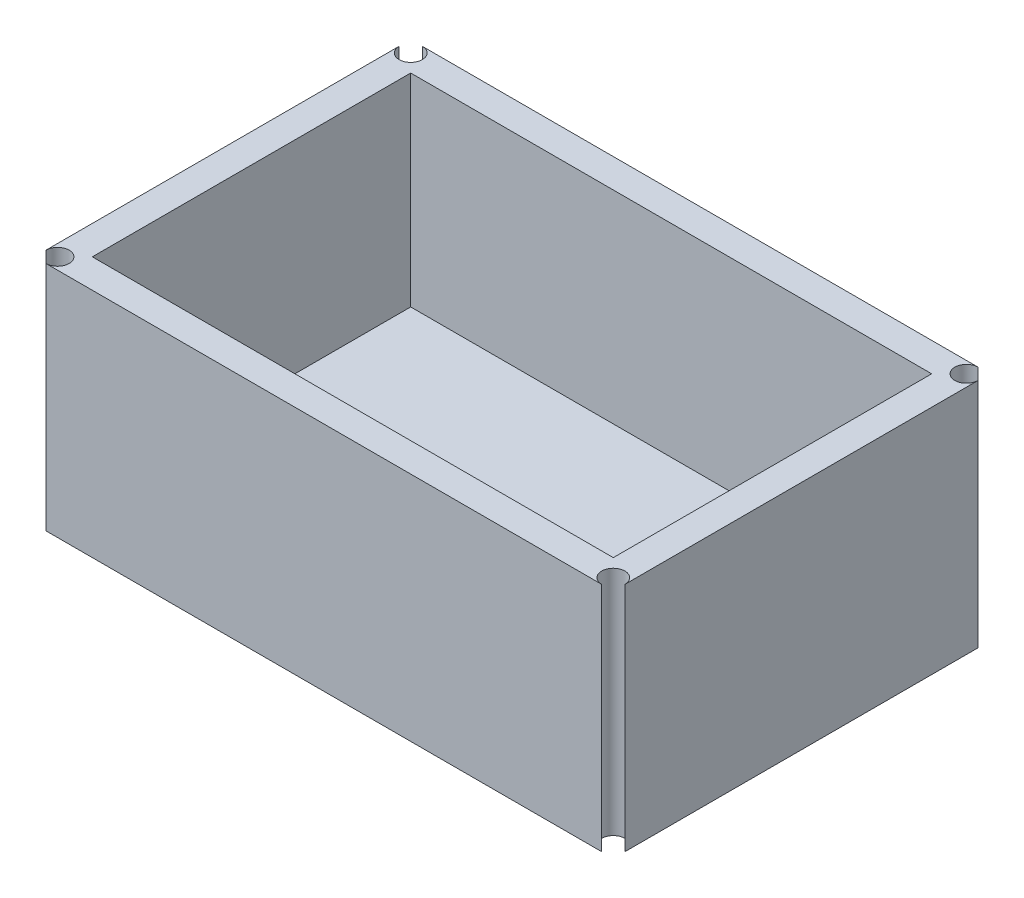
ISO-10303-21;
HEADER;
FILE_DESCRIPTION(('STEP AP214'),'2;1');
FILE_NAME('part.step','',(''),(''),'','','');
FILE_SCHEMA(('AUTOMOTIVE_DESIGN { 1 0 10303 214 1 1 1 1 }'));
ENDSEC;
DATA;
#1=APPLICATION_CONTEXT('core data for automotive mechanical design processes');
#2=APPLICATION_PROTOCOL_DEFINITION('international standard','automotive_design',2000,#1);
#3=PRODUCT_CONTEXT('',#1,'mechanical');
#4=PRODUCT('Part','Part','',(#3));
#5=PRODUCT_RELATED_PRODUCT_CATEGORY('part','',(#4));
#6=PRODUCT_DEFINITION_FORMATION('','',#4);
#7=PRODUCT_DEFINITION_CONTEXT('part definition',#1,'design');
#8=PRODUCT_DEFINITION('design','',#6,#7);
#9=PRODUCT_DEFINITION_SHAPE('','',#8);
#10=(LENGTH_UNIT() NAMED_UNIT(*) SI_UNIT(.MILLI.,.METRE.));
#11=(NAMED_UNIT(*) PLANE_ANGLE_UNIT() SI_UNIT($,.RADIAN.));
#12=(NAMED_UNIT(*) SI_UNIT($,.STERADIAN.) SOLID_ANGLE_UNIT());
#13=UNCERTAINTY_MEASURE_WITH_UNIT(LENGTH_MEASURE(1.E-05),#10,'distance_accuracy_value','');
#14=(GEOMETRIC_REPRESENTATION_CONTEXT(3) GLOBAL_UNCERTAINTY_ASSIGNED_CONTEXT((#13)) GLOBAL_UNIT_ASSIGNED_CONTEXT((#10,
#11,#12)) REPRESENTATION_CONTEXT('',''));
#15=CARTESIAN_POINT('',(0.,0.,0.));
#16=DIRECTION('',(0.,0.,1.));
#17=DIRECTION('',(1.,0.,0.));
#18=AXIS2_PLACEMENT_3D('',#15,#16,#17);
#19=CARTESIAN_POINT('',(0.,40.,0.));
#20=DIRECTION('',(0.,1.,0.));
#21=DIRECTION('',(0.,0.,1.));
#22=AXIS2_PLACEMENT_3D('',#19,#20,#21);
#23=PLANE('',#22);
#24=DIRECTION('',(0.,0.,1.));
#25=VECTOR('',#24,1.);
#26=CARTESIAN_POINT('',(50.9322033898305,40.,-28.0007704160247));
#27=LINE('',#26,#25);
#28=CARTESIAN_POINT('',(50.9322033898305,40.,-28.0007704160247));
#29=VERTEX_POINT('',#28);
#30=CARTESIAN_POINT('',(50.9322033898305,40.,26.9992295839753));
#31=VERTEX_POINT('',#30);
#32=EDGE_CURVE('E188',#29,#31,#27,.T.);
#33=ORIENTED_EDGE('',*,*,#32,.T.);
#34=DIRECTION('',(-1.,0.,0.));
#35=VECTOR('',#34,1.);
#36=CARTESIAN_POINT('',(-39.0677966101695,40.,26.9992295839753));
#37=LINE('',#36,#35);
#38=CARTESIAN_POINT('',(-39.0677966101695,40.,26.9992295839753));
#39=VERTEX_POINT('',#38);
#40=EDGE_CURVE('E183',#31,#39,#37,.T.);
#41=ORIENTED_EDGE('',*,*,#40,.T.);
#42=DIRECTION('',(0.,0.,-1.));
#43=VECTOR('',#42,1.);
#44=CARTESIAN_POINT('',(-39.0677966101695,40.,-28.0007704160247));
#45=LINE('',#44,#43);
#46=CARTESIAN_POINT('',(-39.0677966101695,40.,-28.0007704160247));
#47=VERTEX_POINT('',#46);
#48=EDGE_CURVE('E194',#39,#47,#45,.T.);
#49=ORIENTED_EDGE('',*,*,#48,.T.);
#50=DIRECTION('',(1.,0.,0.));
#51=VECTOR('',#50,1.);
#52=CARTESIAN_POINT('',(-39.0677966101695,40.,-28.0007704160247));
#53=LINE('',#52,#51);
#54=EDGE_CURVE('E191',#47,#29,#53,.T.);
#55=ORIENTED_EDGE('',*,*,#54,.T.);
#56=EDGE_LOOP('',(#33,#41,#49,#55));
#57=FACE_BOUND('',#56,.T.);
#58=DIRECTION('',(1.,0.,0.));
#59=VECTOR('',#58,1.);
#60=CARTESIAN_POINT('',(-44.0677966101695,40.,31.9992295839753));
#61=LINE('',#60,#59);
#62=CARTESIAN_POINT('',(-42.0677966101695,40.,31.9992295839753));
#63=VERTEX_POINT('',#62);
#64=CARTESIAN_POINT('',(53.9322033898305,40.,31.9992295839753));
#65=VERTEX_POINT('',#64);
#66=EDGE_CURVE('E142',#63,#65,#61,.T.);
#67=ORIENTED_EDGE('',*,*,#66,.T.);
#68=CARTESIAN_POINT('',(53.9322033898305,40.,29.9992295839753));
#69=DIRECTION('',(0.,1.,0.));
#70=DIRECTION('',(0.,0.,1.));
#71=AXIS2_PLACEMENT_3D('',#68,#69,#70);
#72=CIRCLE('',#71,2.);
#73=CARTESIAN_POINT('',(55.9322033898305,40.,29.9992295839753));
#74=VERTEX_POINT('',#73);
#75=EDGE_CURVE('E169',#65,#74,#72,.F.);
#76=ORIENTED_EDGE('',*,*,#75,.T.);
#77=DIRECTION('',(0.,0.,1.));
#78=VECTOR('',#77,1.);
#79=CARTESIAN_POINT('',(55.9322033898305,40.,29.9992295839753));
#80=LINE('',#79,#78);
#81=CARTESIAN_POINT('',(55.9322033898305,40.,-31.0007704160247));
#82=VERTEX_POINT('',#81);
#83=EDGE_CURVE('E136',#82,#74,#80,.T.);
#84=ORIENTED_EDGE('',*,*,#83,.F.);
#85=CARTESIAN_POINT('',(53.9322033898305,40.,-31.0007704160247));
#86=DIRECTION('',(0.,1.,0.));
#87=DIRECTION('',(0.,0.,1.));
#88=AXIS2_PLACEMENT_3D('',#85,#86,#87);
#89=CIRCLE('',#88,2.);
#90=CARTESIAN_POINT('',(53.9322033898305,40.,-33.0007704160247));
#91=VERTEX_POINT('',#90);
#92=EDGE_CURVE('E180',#82,#91,#89,.F.);
#93=ORIENTED_EDGE('',*,*,#92,.T.);
#94=DIRECTION('',(-1.,0.,0.));
#95=VECTOR('',#94,1.);
#96=CARTESIAN_POINT('',(-44.0677966101695,40.,-33.0007704160247));
#97=LINE('',#96,#95);
#98=CARTESIAN_POINT('',(-42.0677966101695,40.,-33.0007704160247));
#99=VERTEX_POINT('',#98);
#100=EDGE_CURVE('E135',#91,#99,#97,.T.);
#101=ORIENTED_EDGE('',*,*,#100,.T.);
#102=CARTESIAN_POINT('',(-42.0677966101695,40.,-31.0007704160247));
#103=DIRECTION('',(0.,1.,0.));
#104=DIRECTION('',(0.,0.,1.));
#105=AXIS2_PLACEMENT_3D('',#102,#103,#104);
#106=CIRCLE('',#105,2.);
#107=CARTESIAN_POINT('',(-44.0677966101695,40.,-31.0007704160247));
#108=VERTEX_POINT('',#107);
#109=EDGE_CURVE('E120',#99,#108,#106,.F.);
#110=ORIENTED_EDGE('',*,*,#109,.T.);
#111=DIRECTION('',(0.,0.,1.));
#112=VECTOR('',#111,1.);
#113=CARTESIAN_POINT('',(-44.0677966101695,40.,-33.0007704160247));
#114=LINE('',#113,#112);
#115=CARTESIAN_POINT('',(-44.0677966101695,40.,29.9992295839753));
#116=VERTEX_POINT('',#115);
#117=EDGE_CURVE('E133',#108,#116,#114,.T.);
#118=ORIENTED_EDGE('',*,*,#117,.T.);
#119=CARTESIAN_POINT('',(-42.0677966101695,40.,29.9992295839753));
#120=DIRECTION('',(0.,1.,0.));
#121=DIRECTION('',(0.,0.,1.));
#122=AXIS2_PLACEMENT_3D('',#119,#120,#121);
#123=CIRCLE('',#122,2.);
#124=EDGE_CURVE('E137',#116,#63,#123,.F.);
#125=ORIENTED_EDGE('',*,*,#124,.T.);
#126=EDGE_LOOP('',(#67,#76,#84,#93,#101,#110,#118,#125));
#127=FACE_BOUND('',#126,.T.);
#128=ADVANCED_FACE('F32',(#57,#127),#23,.T.);
#129=CARTESIAN_POINT('',(-42.0677966101695,-0.00999999999999612,29.9992295839753));
#130=DIRECTION('',(0.,1.,0.));
#131=DIRECTION('',(0.,0.,1.));
#132=AXIS2_PLACEMENT_3D('',#129,#130,#131);
#133=CYLINDRICAL_SURFACE('',#132,2.);
#134=ORIENTED_EDGE('',*,*,#124,.F.);
#135=DIRECTION('',(0.,1.,0.));
#136=VECTOR('',#135,1.);
#137=CARTESIAN_POINT('',(-44.0677966101695,-0.00999999999999612,29.9992295839753));
#138=LINE('',#137,#136);
#139=CARTESIAN_POINT('',(-44.0677966101695,0.,29.9992295839753));
#140=VERTEX_POINT('',#139);
#141=EDGE_CURVE('E127',#140,#116,#138,.T.);
#142=ORIENTED_EDGE('',*,*,#141,.F.);
#143=CARTESIAN_POINT('',(-42.0677966101695,0.,29.9992295839753));
#144=DIRECTION('',(0.,1.,0.));
#145=DIRECTION('',(0.,0.,1.));
#146=AXIS2_PLACEMENT_3D('',#143,#144,#145);
#147=CIRCLE('',#146,2.);
#148=CARTESIAN_POINT('',(-42.0677966101695,0.,31.9992295839753));
#149=VERTEX_POINT('',#148);
#150=EDGE_CURVE('E235',#149,#140,#147,.T.);
#151=ORIENTED_EDGE('',*,*,#150,.F.);
#152=DIRECTION('',(0.,1.,0.));
#153=VECTOR('',#152,1.);
#154=CARTESIAN_POINT('',(-42.0677966101695,-0.00999999999999612,31.9992295839753));
#155=LINE('',#154,#153);
#156=EDGE_CURVE('E126',#149,#63,#155,.T.);
#157=ORIENTED_EDGE('',*,*,#156,.T.);
#158=EDGE_LOOP('',(#134,#142,#151,#157));
#159=FACE_BOUND('',#158,.T.);
#160=ADVANCED_FACE('F258',(#159),#133,.F.);
#161=CARTESIAN_POINT('',(-44.0677966101695,80.,31.9992295839753));
#162=DIRECTION('',(0.,0.,-1.));
#163=DIRECTION('',(-1.,0.,0.));
#164=AXIS2_PLACEMENT_3D('',#161,#162,#163);
#165=PLANE('',#164);
#166=ORIENTED_EDGE('',*,*,#66,.F.);
#167=ORIENTED_EDGE('',*,*,#156,.F.);
#168=DIRECTION('',(1.,0.,0.));
#169=VECTOR('',#168,1.);
#170=CARTESIAN_POINT('',(-44.0677966101695,0.,31.9992295839753));
#171=LINE('',#170,#169);
#172=CARTESIAN_POINT('',(53.9322033898305,0.,31.9992295839753));
#173=VERTEX_POINT('',#172);
#174=EDGE_CURVE('E233',#149,#173,#171,.T.);
#175=ORIENTED_EDGE('',*,*,#174,.T.);
#176=DIRECTION('',(0.,1.,0.));
#177=VECTOR('',#176,1.);
#178=CARTESIAN_POINT('',(53.9322033898305,-0.00999999999999612,31.9992295839753));
#179=LINE('',#178,#177);
#180=EDGE_CURVE('E160',#173,#65,#179,.T.);
#181=ORIENTED_EDGE('',*,*,#180,.T.);
#182=EDGE_LOOP('',(#166,#167,#175,#181));
#183=FACE_BOUND('',#182,.T.);
#184=ADVANCED_FACE('F268',(#183),#165,.F.);
#185=CARTESIAN_POINT('',(53.9322033898305,-0.00999999999999612,29.9992295839753));
#186=DIRECTION('',(0.,1.,0.));
#187=DIRECTION('',(0.,0.,1.));
#188=AXIS2_PLACEMENT_3D('',#185,#186,#187);
#189=CYLINDRICAL_SURFACE('',#188,2.);
#190=ORIENTED_EDGE('',*,*,#75,.F.);
#191=ORIENTED_EDGE('',*,*,#180,.F.);
#192=CARTESIAN_POINT('',(53.9322033898305,0.,29.9992295839753));
#193=DIRECTION('',(0.,1.,0.));
#194=DIRECTION('',(0.,0.,1.));
#195=AXIS2_PLACEMENT_3D('',#192,#193,#194);
#196=CIRCLE('',#195,2.);
#197=CARTESIAN_POINT('',(55.9322033898305,0.,29.9992295839753));
#198=VERTEX_POINT('',#197);
#199=EDGE_CURVE('E171',#198,#173,#196,.T.);
#200=ORIENTED_EDGE('',*,*,#199,.F.);
#201=DIRECTION('',(0.,1.,0.));
#202=VECTOR('',#201,1.);
#203=CARTESIAN_POINT('',(55.9322033898305,-0.00999999999999612,29.9992295839753));
#204=LINE('',#203,#202);
#205=EDGE_CURVE('E40',#198,#74,#204,.T.);
#206=ORIENTED_EDGE('',*,*,#205,.T.);
#207=EDGE_LOOP('',(#190,#191,#200,#206));
#208=FACE_BOUND('',#207,.T.);
#209=ADVANCED_FACE('F167',(#208),#189,.F.);
#210=CARTESIAN_POINT('',(53.9322033898305,-0.00999999999999612,-31.0007704160247));
#211=DIRECTION('',(0.,1.,0.));
#212=DIRECTION('',(0.,0.,1.));
#213=AXIS2_PLACEMENT_3D('',#210,#211,#212);
#214=CYLINDRICAL_SURFACE('',#213,2.);
#215=ORIENTED_EDGE('',*,*,#92,.F.);
#216=DIRECTION('',(0.,1.,0.));
#217=VECTOR('',#216,1.);
#218=CARTESIAN_POINT('',(55.9322033898305,-0.00999999999999612,-31.0007704160247));
#219=LINE('',#218,#217);
#220=CARTESIAN_POINT('',(55.9322033898305,0.,-31.0007704160247));
#221=VERTEX_POINT('',#220);
#222=EDGE_CURVE('E157',#221,#82,#219,.T.);
#223=ORIENTED_EDGE('',*,*,#222,.F.);
#224=CARTESIAN_POINT('',(53.9322033898305,0.,-31.0007704160247));
#225=DIRECTION('',(0.,1.,0.));
#226=DIRECTION('',(0.,0.,1.));
#227=AXIS2_PLACEMENT_3D('',#224,#225,#226);
#228=CIRCLE('',#227,2.);
#229=CARTESIAN_POINT('',(53.9322033898305,0.,-33.0007704160247));
#230=VERTEX_POINT('',#229);
#231=EDGE_CURVE('E228',#230,#221,#228,.T.);
#232=ORIENTED_EDGE('',*,*,#231,.F.);
#233=DIRECTION('',(0.,1.,0.));
#234=VECTOR('',#233,1.);
#235=CARTESIAN_POINT('',(53.9322033898305,-0.00999999999999612,-33.0007704160247));
#236=LINE('',#235,#234);
#237=EDGE_CURVE('E11',#230,#91,#236,.T.);
#238=ORIENTED_EDGE('',*,*,#237,.T.);
#239=EDGE_LOOP('',(#215,#223,#232,#238));
#240=FACE_BOUND('',#239,.T.);
#241=ADVANCED_FACE('F247',(#240),#214,.F.);
#242=CARTESIAN_POINT('',(-44.0677966101695,80.,-33.0007704160247));
#243=DIRECTION('',(0.,0.,1.));
#244=DIRECTION('',(1.,0.,0.));
#245=AXIS2_PLACEMENT_3D('',#242,#243,#244);
#246=PLANE('',#245);
#247=ORIENTED_EDGE('',*,*,#100,.F.);
#248=ORIENTED_EDGE('',*,*,#237,.F.);
#249=DIRECTION('',(-1.,0.,0.));
#250=VECTOR('',#249,1.);
#251=CARTESIAN_POINT('',(-44.0677966101695,0.,-33.0007704160247));
#252=LINE('',#251,#250);
#253=CARTESIAN_POINT('',(-42.0677966101695,0.,-33.0007704160247));
#254=VERTEX_POINT('',#253);
#255=EDGE_CURVE('E231',#230,#254,#252,.T.);
#256=ORIENTED_EDGE('',*,*,#255,.T.);
#257=DIRECTION('',(0.,1.,0.));
#258=VECTOR('',#257,1.);
#259=CARTESIAN_POINT('',(-42.0677966101695,-0.00999999999999612,-33.0007704160247));
#260=LINE('',#259,#258);
#261=EDGE_CURVE('E155',#254,#99,#260,.T.);
#262=ORIENTED_EDGE('',*,*,#261,.T.);
#263=EDGE_LOOP('',(#247,#248,#256,#262));
#264=FACE_BOUND('',#263,.T.);
#265=ADVANCED_FACE('F245',(#264),#246,.F.);
#266=CARTESIAN_POINT('',(-42.0677966101695,-0.00999999999999612,-31.0007704160247));
#267=DIRECTION('',(0.,1.,0.));
#268=DIRECTION('',(0.,0.,1.));
#269=AXIS2_PLACEMENT_3D('',#266,#267,#268);
#270=CYLINDRICAL_SURFACE('',#269,2.);
#271=ORIENTED_EDGE('',*,*,#109,.F.);
#272=ORIENTED_EDGE('',*,*,#261,.F.);
#273=CARTESIAN_POINT('',(-42.0677966101695,0.,-31.0007704160247));
#274=DIRECTION('',(0.,1.,0.));
#275=DIRECTION('',(0.,0.,1.));
#276=AXIS2_PLACEMENT_3D('',#273,#274,#275);
#277=CIRCLE('',#276,2.);
#278=CARTESIAN_POINT('',(-44.0677966101695,0.,-31.0007704160247));
#279=VERTEX_POINT('',#278);
#280=EDGE_CURVE('E47',#279,#254,#277,.T.);
#281=ORIENTED_EDGE('',*,*,#280,.F.);
#282=DIRECTION('',(0.,1.,0.));
#283=VECTOR('',#282,1.);
#284=CARTESIAN_POINT('',(-44.0677966101695,-0.00999999999999612,-31.0007704160247));
#285=LINE('',#284,#283);
#286=EDGE_CURVE('E118',#279,#108,#285,.T.);
#287=ORIENTED_EDGE('',*,*,#286,.T.);
#288=EDGE_LOOP('',(#271,#272,#281,#287));
#289=FACE_BOUND('',#288,.T.);
#290=ADVANCED_FACE('F34',(#289),#270,.F.);
#291=CARTESIAN_POINT('',(-44.0677966101695,80.,-33.0007704160247));
#292=DIRECTION('',(1.,0.,0.));
#293=DIRECTION('',(0.,0.,-1.));
#294=AXIS2_PLACEMENT_3D('',#291,#292,#293);
#295=PLANE('',#294);
#296=ORIENTED_EDGE('',*,*,#117,.F.);
#297=ORIENTED_EDGE('',*,*,#286,.F.);
#298=DIRECTION('',(0.,0.,1.));
#299=VECTOR('',#298,1.);
#300=CARTESIAN_POINT('',(-44.0677966101695,0.,-33.0007704160247));
#301=LINE('',#300,#299);
#302=EDGE_CURVE('E221',#279,#140,#301,.T.);
#303=ORIENTED_EDGE('',*,*,#302,.T.);
#304=ORIENTED_EDGE('',*,*,#141,.T.);
#305=EDGE_LOOP('',(#296,#297,#303,#304));
#306=FACE_BOUND('',#305,.T.);
#307=ADVANCED_FACE('F139',(#306),#295,.F.);
#308=CARTESIAN_POINT('',(0.,0.,0.));
#309=DIRECTION('',(0.,1.,0.));
#310=DIRECTION('',(0.,0.,1.));
#311=AXIS2_PLACEMENT_3D('',#308,#309,#310);
#312=PLANE('',#311);
#313=ORIENTED_EDGE('',*,*,#302,.F.);
#314=ORIENTED_EDGE('',*,*,#280,.T.);
#315=ORIENTED_EDGE('',*,*,#255,.F.);
#316=ORIENTED_EDGE('',*,*,#231,.T.);
#317=DIRECTION('',(0.,0.,-1.));
#318=VECTOR('',#317,1.);
#319=CARTESIAN_POINT('',(55.9322033898305,0.,-33.0007704160247));
#320=LINE('',#319,#318);
#321=EDGE_CURVE('E176',#198,#221,#320,.T.);
#322=ORIENTED_EDGE('',*,*,#321,.F.);
#323=ORIENTED_EDGE('',*,*,#199,.T.);
#324=ORIENTED_EDGE('',*,*,#174,.F.);
#325=ORIENTED_EDGE('',*,*,#150,.T.);
#326=EDGE_LOOP('',(#313,#314,#315,#316,#322,#323,#324,#325));
#327=FACE_BOUND('',#326,.T.);
#328=ADVANCED_FACE('F244',(#327),#312,.F.);
#329=CARTESIAN_POINT('',(55.9322033898305,80.,-33.0007704160247));
#330=DIRECTION('',(-1.,0.,0.));
#331=DIRECTION('',(0.,0.,1.));
#332=AXIS2_PLACEMENT_3D('',#329,#330,#331);
#333=PLANE('',#332);
#334=ORIENTED_EDGE('',*,*,#222,.T.);
#335=ORIENTED_EDGE('',*,*,#83,.T.);
#336=ORIENTED_EDGE('',*,*,#205,.F.);
#337=ORIENTED_EDGE('',*,*,#321,.T.);
#338=EDGE_LOOP('',(#334,#335,#336,#337));
#339=FACE_BOUND('',#338,.T.);
#340=ADVANCED_FACE('F175',(#339),#333,.F.);
#341=CARTESIAN_POINT('',(-39.0677966101695,-175.475115548645,26.9992295839753));
#342=DIRECTION('',(0.,0.,1.));
#343=DIRECTION('',(1.,0.,0.));
#344=AXIS2_PLACEMENT_3D('',#341,#342,#343);
#345=PLANE('',#344);
#346=ORIENTED_EDGE('',*,*,#40,.F.);
#347=DIRECTION('',(0.,1.,0.));
#348=VECTOR('',#347,1.);
#349=CARTESIAN_POINT('',(50.9322033898305,-175.475115548645,26.9992295839753));
#350=LINE('',#349,#348);
#351=CARTESIAN_POINT('',(50.9322033898305,5.,26.9992295839753));
#352=VERTEX_POINT('',#351);
#353=EDGE_CURVE('E148',#352,#31,#350,.T.);
#354=ORIENTED_EDGE('',*,*,#353,.F.);
#355=DIRECTION('',(-1.,0.,0.));
#356=VECTOR('',#355,1.);
#357=CARTESIAN_POINT('',(-39.0677966101695,5.,26.9992295839753));
#358=LINE('',#357,#356);
#359=CARTESIAN_POINT('',(-39.0677966101695,5.,26.9992295839753));
#360=VERTEX_POINT('',#359);
#361=EDGE_CURVE('E219',#352,#360,#358,.T.);
#362=ORIENTED_EDGE('',*,*,#361,.T.);
#363=DIRECTION('',(0.,1.,0.));
#364=VECTOR('',#363,1.);
#365=CARTESIAN_POINT('',(-39.0677966101695,-175.475115548645,26.9992295839753));
#366=LINE('',#365,#364);
#367=EDGE_CURVE('E146',#360,#39,#366,.T.);
#368=ORIENTED_EDGE('',*,*,#367,.T.);
#369=EDGE_LOOP('',(#346,#354,#362,#368));
#370=FACE_BOUND('',#369,.T.);
#371=ADVANCED_FACE('F218',(#370),#345,.F.);
#372=CARTESIAN_POINT('',(50.9322033898305,-175.475115548645,-28.0007704160247));
#373=DIRECTION('',(1.,0.,0.));
#374=DIRECTION('',(0.,0.,-1.));
#375=AXIS2_PLACEMENT_3D('',#372,#373,#374);
#376=PLANE('',#375);
#377=ORIENTED_EDGE('',*,*,#32,.F.);
#378=DIRECTION('',(0.,1.,0.));
#379=VECTOR('',#378,1.);
#380=CARTESIAN_POINT('',(50.9322033898305,-175.475115548645,-28.0007704160247));
#381=LINE('',#380,#379);
#382=CARTESIAN_POINT('',(50.9322033898305,5.,-28.0007704160247));
#383=VERTEX_POINT('',#382);
#384=EDGE_CURVE('E150',#383,#29,#381,.T.);
#385=ORIENTED_EDGE('',*,*,#384,.F.);
#386=DIRECTION('',(0.,0.,1.));
#387=VECTOR('',#386,1.);
#388=CARTESIAN_POINT('',(50.9322033898305,5.,-28.0007704160247));
#389=LINE('',#388,#387);
#390=EDGE_CURVE('E154',#383,#352,#389,.T.);
#391=ORIENTED_EDGE('',*,*,#390,.T.);
#392=ORIENTED_EDGE('',*,*,#353,.T.);
#393=EDGE_LOOP('',(#377,#385,#391,#392));
#394=FACE_BOUND('',#393,.T.);
#395=ADVANCED_FACE('F214',(#394),#376,.F.);
#396=CARTESIAN_POINT('',(-39.0677966101695,-175.475115548645,-28.0007704160247));
#397=DIRECTION('',(0.,0.,-1.));
#398=DIRECTION('',(-1.,0.,0.));
#399=AXIS2_PLACEMENT_3D('',#396,#397,#398);
#400=PLANE('',#399);
#401=ORIENTED_EDGE('',*,*,#54,.F.);
#402=DIRECTION('',(0.,1.,0.));
#403=VECTOR('',#402,1.);
#404=CARTESIAN_POINT('',(-39.0677966101695,-175.475115548645,-28.0007704160247));
#405=LINE('',#404,#403);
#406=CARTESIAN_POINT('',(-39.0677966101695,5.,-28.0007704160247));
#407=VERTEX_POINT('',#406);
#408=EDGE_CURVE('E152',#407,#47,#405,.T.);
#409=ORIENTED_EDGE('',*,*,#408,.F.);
#410=DIRECTION('',(1.,0.,0.));
#411=VECTOR('',#410,1.);
#412=CARTESIAN_POINT('',(-39.0677966101695,5.,-28.0007704160247));
#413=LINE('',#412,#411);
#414=EDGE_CURVE('E211',#407,#383,#413,.T.);
#415=ORIENTED_EDGE('',*,*,#414,.T.);
#416=ORIENTED_EDGE('',*,*,#384,.T.);
#417=EDGE_LOOP('',(#401,#409,#415,#416));
#418=FACE_BOUND('',#417,.T.);
#419=ADVANCED_FACE('F208',(#418),#400,.F.);
#420=CARTESIAN_POINT('',(-39.0677966101695,-175.475115548645,-28.0007704160247));
#421=DIRECTION('',(-1.,0.,0.));
#422=DIRECTION('',(0.,0.,1.));
#423=AXIS2_PLACEMENT_3D('',#420,#421,#422);
#424=PLANE('',#423);
#425=ORIENTED_EDGE('',*,*,#48,.F.);
#426=ORIENTED_EDGE('',*,*,#367,.F.);
#427=DIRECTION('',(0.,0.,-1.));
#428=VECTOR('',#427,1.);
#429=CARTESIAN_POINT('',(-39.0677966101695,5.,-28.0007704160247));
#430=LINE('',#429,#428);
#431=EDGE_CURVE('E205',#360,#407,#430,.T.);
#432=ORIENTED_EDGE('',*,*,#431,.T.);
#433=ORIENTED_EDGE('',*,*,#408,.T.);
#434=EDGE_LOOP('',(#425,#426,#432,#433));
#435=FACE_BOUND('',#434,.T.);
#436=ADVANCED_FACE('F202',(#435),#424,.F.);
#437=CARTESIAN_POINT('',(0.,5.,0.));
#438=DIRECTION('',(0.,1.,0.));
#439=DIRECTION('',(0.,0.,1.));
#440=AXIS2_PLACEMENT_3D('',#437,#438,#439);
#441=PLANE('',#440);
#442=ORIENTED_EDGE('',*,*,#431,.F.);
#443=ORIENTED_EDGE('',*,*,#361,.F.);
#444=ORIENTED_EDGE('',*,*,#390,.F.);
#445=ORIENTED_EDGE('',*,*,#414,.F.);
#446=EDGE_LOOP('',(#442,#443,#444,#445));
#447=FACE_BOUND('',#446,.T.);
#448=ADVANCED_FACE('F223',(#447),#441,.T.);
#449=CLOSED_SHELL('',(#128,#160,#184,#209,#241,#265,#290,#307,#328,#340,#371,#395,#419,#436,#448));
#450=MANIFOLD_SOLID_BREP('B2',#449);
#451=ADVANCED_BREP_SHAPE_REPRESENTATION('',(#18,#450),#14);
#452=SHAPE_DEFINITION_REPRESENTATION(#9,#451);
ENDSEC;
END-ISO-10303-21;
